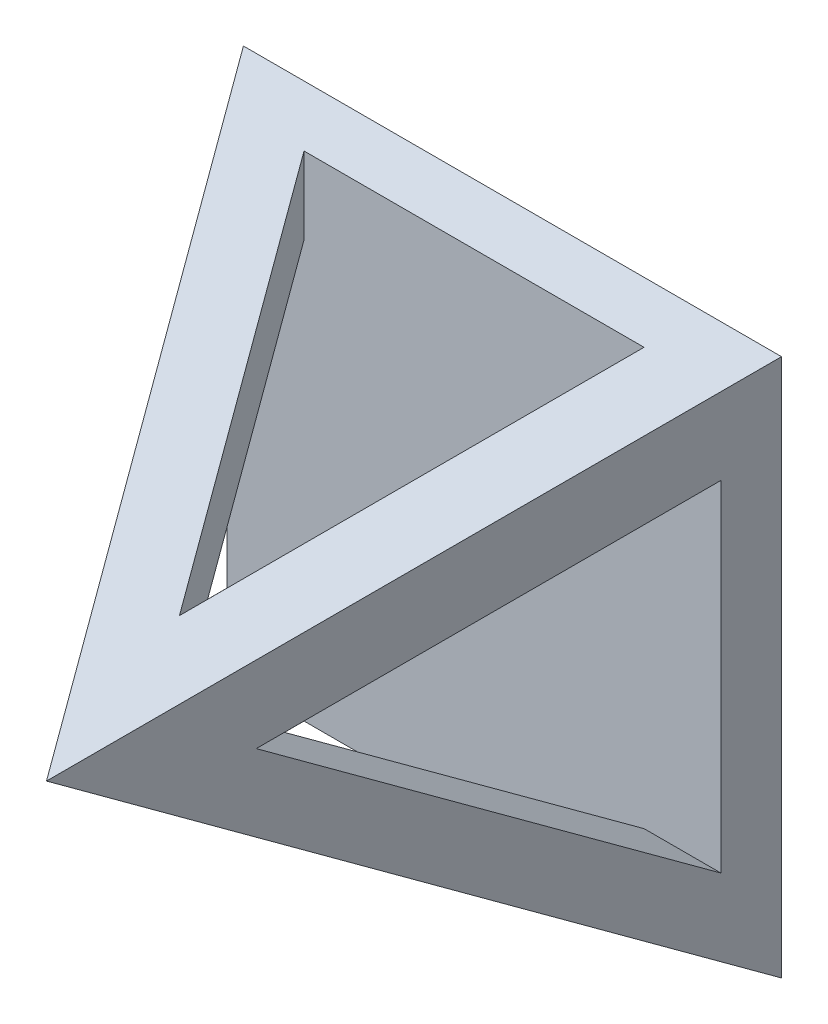
ISO-10303-21;
HEADER;
FILE_DESCRIPTION(('STEP AP214'),'2;1');
FILE_NAME('part.step','',(''),(''),'','','');
FILE_SCHEMA(('AUTOMOTIVE_DESIGN { 1 0 10303 214 1 1 1 1 }'));
ENDSEC;
DATA;
#1=APPLICATION_CONTEXT('core data for automotive mechanical design processes');
#2=APPLICATION_PROTOCOL_DEFINITION('international standard','automotive_design',2000,#1);
#3=PRODUCT_CONTEXT('',#1,'mechanical');
#4=PRODUCT('Part','Part','',(#3));
#5=PRODUCT_RELATED_PRODUCT_CATEGORY('part','',(#4));
#6=PRODUCT_DEFINITION_FORMATION('','',#4);
#7=PRODUCT_DEFINITION_CONTEXT('part definition',#1,'design');
#8=PRODUCT_DEFINITION('design','',#6,#7);
#9=PRODUCT_DEFINITION_SHAPE('','',#8);
#10=(LENGTH_UNIT() NAMED_UNIT(*) SI_UNIT(.MILLI.,.METRE.));
#11=(NAMED_UNIT(*) PLANE_ANGLE_UNIT() SI_UNIT($,.RADIAN.));
#12=(NAMED_UNIT(*) SI_UNIT($,.STERADIAN.) SOLID_ANGLE_UNIT());
#13=UNCERTAINTY_MEASURE_WITH_UNIT(LENGTH_MEASURE(1.E-05),#10,'distance_accuracy_value','');
#14=(GEOMETRIC_REPRESENTATION_CONTEXT(3) GLOBAL_UNCERTAINTY_ASSIGNED_CONTEXT((#13)) GLOBAL_UNIT_ASSIGNED_CONTEXT((#10,
#11,#12)) REPRESENTATION_CONTEXT('',''));
#15=CARTESIAN_POINT('',(0.,0.,0.));
#16=DIRECTION('',(0.,0.,1.));
#17=DIRECTION('',(1.,0.,0.));
#18=AXIS2_PLACEMENT_3D('',#15,#16,#17);
#19=CARTESIAN_POINT('',(-7.,7.,0.));
#20=DIRECTION('',(-0.866025403784438,0.,0.500000000000001));
#21=DIRECTION('',(0.500000000000001,0.,0.866025403784438));
#22=AXIS2_PLACEMENT_3D('',#19,#20,#21);
#23=PLANE('',#22);
#24=DIRECTION('',(0.,-1.,0.));
#25=VECTOR('',#24,1.);
#26=CARTESIAN_POINT('',(-7.,7.,0.));
#27=LINE('',#26,#25);
#28=CARTESIAN_POINT('',(-7.,7.,0.));
#29=VERTEX_POINT('',#28);
#30=CARTESIAN_POINT('',(-7.,-7.,0.));
#31=VERTEX_POINT('',#30);
#32=EDGE_CURVE('E161',#29,#31,#27,.T.);
#33=ORIENTED_EDGE('',*,*,#32,.T.);
#34=DIRECTION('',(-0.447213595499959,-0.447213595499959,-0.774596669241483));
#35=VECTOR('',#34,1.);
#36=CARTESIAN_POINT('',(-7.,-7.,0.));
#37=LINE('',#36,#35);
#38=CARTESIAN_POINT('',(0.,0.,12.1243556529821));
#39=VERTEX_POINT('',#38);
#40=EDGE_CURVE('E174',#39,#31,#37,.T.);
#41=ORIENTED_EDGE('',*,*,#40,.F.);
#42=DIRECTION('',(-0.447213595499959,0.447213595499959,-0.774596669241483));
#43=VECTOR('',#42,1.);
#44=CARTESIAN_POINT('',(-7.,7.,0.));
#45=LINE('',#44,#43);
#46=EDGE_CURVE('E173',#39,#29,#45,.T.);
#47=ORIENTED_EDGE('',*,*,#46,.T.);
#48=EDGE_LOOP('',(#33,#41,#47));
#49=FACE_BOUND('',#48,.T.);
#50=DIRECTION('',(0.,1.,0.));
#51=VECTOR('',#50,1.);
#52=CARTESIAN_POINT('',(-6.42264973081037,7.,0.999999999999999));
#53=LINE('',#52,#51);
#54=CARTESIAN_POINT('',(-6.42264973081037,4.42292304237542,0.999999999999999));
#55=VERTEX_POINT('',#54);
#56=CARTESIAN_POINT('',(-6.42264973081037,-4.42292304237547,0.999999999999999));
#57=VERTEX_POINT('',#56);
#58=EDGE_CURVE('E133',#55,#57,#53,.F.);
#59=ORIENTED_EDGE('',*,*,#58,.F.);
#60=DIRECTION('',(0.447255932734875,-0.447044206464897,0.77466999948341));
#61=VECTOR('',#60,1.);
#62=CARTESIAN_POINT('',(-7.39988634707236,5.39969704506764,-0.692623470382456));
#63=LINE('',#62,#61);
#64=CARTESIAN_POINT('',(-1.99763193139611,0.,8.66435565298211));
#65=VERTEX_POINT('',#64);
#66=EDGE_CURVE('E128',#65,#55,#63,.F.);
#67=ORIENTED_EDGE('',*,*,#66,.F.);
#68=DIRECTION('',(-0.447255932734875,-0.4470442064649,-0.774669999483409));
#69=VECTOR('',#68,1.);
#70=CARTESIAN_POINT('',(-4.60068191756582,-2.60181772959403,4.15574082229471));
#71=LINE('',#70,#69);
#72=EDGE_CURVE('E115',#57,#65,#71,.F.);
#73=ORIENTED_EDGE('',*,*,#72,.F.);
#74=EDGE_LOOP('',(#59,#67,#73));
#75=FACE_BOUND('',#74,.T.);
#76=ADVANCED_FACE('F33',(#49,#75),#23,.T.);
#77=CARTESIAN_POINT('',(7.,7.,0.));
#78=DIRECTION('',(0.866025403784438,0.,0.500000000000001));
#79=DIRECTION('',(0.500000000000001,0.,-0.866025403784438));
#80=AXIS2_PLACEMENT_3D('',#77,#78,#79);
#81=PLANE('',#80);
#82=DIRECTION('',(0.,1.,0.));
#83=VECTOR('',#82,1.);
#84=CARTESIAN_POINT('',(7.,7.,0.));
#85=LINE('',#84,#83);
#86=CARTESIAN_POINT('',(7.,-7.,0.));
#87=VERTEX_POINT('',#86);
#88=CARTESIAN_POINT('',(7.,7.,0.));
#89=VERTEX_POINT('',#88);
#90=EDGE_CURVE('E167',#87,#89,#85,.T.);
#91=ORIENTED_EDGE('',*,*,#90,.T.);
#92=DIRECTION('',(0.447213595499959,0.447213595499959,-0.774596669241483));
#93=VECTOR('',#92,1.);
#94=CARTESIAN_POINT('',(4.19999999999999,4.19999999999999,4.84974226119286));
#95=LINE('',#94,#93);
#96=EDGE_CURVE('E180',#39,#89,#95,.T.);
#97=ORIENTED_EDGE('',*,*,#96,.F.);
#98=DIRECTION('',(0.447213595499959,-0.447213595499959,-0.774596669241483));
#99=VECTOR('',#98,1.);
#100=CARTESIAN_POINT('',(4.19999999999999,-4.19999999999999,4.84974226119286));
#101=LINE('',#100,#99);
#102=EDGE_CURVE('E178',#39,#87,#101,.T.);
#103=ORIENTED_EDGE('',*,*,#102,.T.);
#104=EDGE_LOOP('',(#91,#97,#103));
#105=FACE_BOUND('',#104,.T.);
#106=DIRECTION('',(0.,-1.,0.));
#107=VECTOR('',#106,1.);
#108=CARTESIAN_POINT('',(6.42264973081037,7.,1.));
#109=LINE('',#108,#107);
#110=CARTESIAN_POINT('',(6.42264973081037,-4.42292304237543,1.));
#111=VERTEX_POINT('',#110);
#112=CARTESIAN_POINT('',(6.42264973081037,4.42292304237547,1.));
#113=VERTEX_POINT('',#112);
#114=EDGE_CURVE('E134',#111,#113,#109,.F.);
#115=ORIENTED_EDGE('',*,*,#114,.F.);
#116=DIRECTION('',(-0.447255932734875,0.447044206464898,0.77466999948341));
#117=VECTOR('',#116,1.);
#118=CARTESIAN_POINT('',(4.60068191756584,-2.60181772959402,4.15574082229468));
#119=LINE('',#118,#117);
#120=CARTESIAN_POINT('',(1.99763193139611,0.,8.66435565298211));
#121=VERTEX_POINT('',#120);
#122=EDGE_CURVE('E124',#121,#111,#119,.F.);
#123=ORIENTED_EDGE('',*,*,#122,.F.);
#124=DIRECTION('',(0.447255932734875,0.4470442064649,-0.774669999483409));
#125=VECTOR('',#124,1.);
#126=CARTESIAN_POINT('',(7.39988634707236,5.39969704506768,-0.692623470382442));
#127=LINE('',#126,#125);
#128=EDGE_CURVE('E135',#113,#121,#127,.F.);
#129=ORIENTED_EDGE('',*,*,#128,.F.);
#130=EDGE_LOOP('',(#115,#123,#129));
#131=FACE_BOUND('',#130,.T.);
#132=ADVANCED_FACE('F228',(#105,#131),#81,.T.);
#133=CARTESIAN_POINT('',(3.75088760529464,-7.,2.16455080765507));
#134=DIRECTION('',(-0.866127889551496,0.,-0.499822447416151));
#135=DIRECTION('',(-0.499822447416151,0.,0.866127889551496));
#136=AXIS2_PLACEMENT_3D('',#133,#134,#135);
#137=PLANE('',#136);
#138=DIRECTION('',(0.,1.,0.));
#139=VECTOR('',#138,1.);
#140=CARTESIAN_POINT('',(4.42292304237545,-7.,1.));
#141=LINE('',#140,#139);
#142=CARTESIAN_POINT('',(4.42292304237545,4.42292304237546,0.999999999999999));
#143=VERTEX_POINT('',#142);
#144=CARTESIAN_POINT('',(4.42292304237545,6.42264973081037,1.));
#145=VERTEX_POINT('',#144);
#146=EDGE_CURVE('E147',#143,#145,#141,.T.);
#147=ORIENTED_EDGE('',*,*,#146,.F.);
#148=DIRECTION('',(-0.447086535678458,-0.44708653567846,0.774743350555568));
#149=VECTOR('',#148,1.);
#150=CARTESIAN_POINT('',(1.60193170345558,1.60193170345558,5.8884144508768));
#151=LINE('',#150,#149);
#152=CARTESIAN_POINT('',(0.,0.,8.66435565298211));
#153=VERTEX_POINT('',#152);
#154=EDGE_CURVE('E123',#143,#153,#151,.T.);
#155=ORIENTED_EDGE('',*,*,#154,.T.);
#156=DIRECTION('',(0.,1.,0.));
#157=VECTOR('',#156,1.);
#158=CARTESIAN_POINT('',(0.,-7.,8.66435565298211));
#159=LINE('',#158,#157);
#160=CARTESIAN_POINT('',(0.,1.99763193139611,8.66435565298211));
#161=VERTEX_POINT('',#160);
#162=EDGE_CURVE('E151',#153,#161,#159,.T.);
#163=ORIENTED_EDGE('',*,*,#162,.T.);
#164=DIRECTION('',(-0.447044206464899,-0.447255932734875,0.77466999948341));
#165=VECTOR('',#164,1.);
#166=CARTESIAN_POINT('',(2.60181772959403,4.60068191756584,4.15574082229469));
#167=LINE('',#166,#165);
#168=EDGE_CURVE('E185',#161,#145,#167,.F.);
#169=ORIENTED_EDGE('',*,*,#168,.T.);
#170=EDGE_LOOP('',(#147,#155,#163,#169));
#171=FACE_BOUND('',#170,.T.);
#172=ADVANCED_FACE('F209',(#171),#137,.T.);
#173=CARTESIAN_POINT('',(0.,-1.99763193139611,8.66435565298211));
#174=VERTEX_POINT('',#173);
#175=EDGE_CURVE('E148',#174,#153,#159,.T.);
#176=ORIENTED_EDGE('',*,*,#175,.T.);
#177=DIRECTION('',(0.447086535678459,-0.447086535678458,-0.774743350555569));
#178=VECTOR('',#177,1.);
#179=CARTESIAN_POINT('',(4.4003408888451,-4.40034088884509,1.03913196191943));
#180=LINE('',#179,#178);
#181=CARTESIAN_POINT('',(4.42292304237545,-4.42292304237543,1.));
#182=VERTEX_POINT('',#181);
#183=EDGE_CURVE('E198',#153,#182,#180,.T.);
#184=ORIENTED_EDGE('',*,*,#183,.T.);
#185=CARTESIAN_POINT('',(4.42292304237545,-6.42264973081037,1.));
#186=VERTEX_POINT('',#185);
#187=EDGE_CURVE('E143',#186,#182,#141,.T.);
#188=ORIENTED_EDGE('',*,*,#187,.F.);
#189=DIRECTION('',(0.447044206464899,-0.447255932734875,-0.77466999948341));
#190=VECTOR('',#189,1.);
#191=CARTESIAN_POINT('',(2.60181772959403,-4.60068191756584,4.15574082229469));
#192=LINE('',#191,#190);
#193=EDGE_CURVE('E156',#186,#174,#192,.F.);
#194=ORIENTED_EDGE('',*,*,#193,.T.);
#195=EDGE_LOOP('',(#176,#184,#188,#194));
#196=FACE_BOUND('',#195,.T.);
#197=ADVANCED_FACE('F196',(#196),#137,.T.);
#198=CARTESIAN_POINT('',(-3.75088760529464,-7.,2.16455080765507));
#199=DIRECTION('',(0.866127889551496,0.,-0.499822447416151));
#200=DIRECTION('',(-0.499822447416151,0.,-0.866127889551496));
#201=AXIS2_PLACEMENT_3D('',#198,#199,#200);
#202=PLANE('',#201);
#203=ORIENTED_EDGE('',*,*,#162,.F.);
#204=DIRECTION('',(-0.447086535678459,0.447086535678457,-0.774743350555569));
#205=VECTOR('',#204,1.);
#206=CARTESIAN_POINT('',(-1.60193170345559,1.60193170345558,5.88841445087677));
#207=LINE('',#206,#205);
#208=CARTESIAN_POINT('',(-4.42292304237545,4.42292304237543,0.999999999999999));
#209=VERTEX_POINT('',#208);
#210=EDGE_CURVE('E11',#153,#209,#207,.T.);
#211=ORIENTED_EDGE('',*,*,#210,.T.);
#212=DIRECTION('',(0.,1.,0.));
#213=VECTOR('',#212,1.);
#214=CARTESIAN_POINT('',(-4.42292304237545,-7.,0.999999999999999));
#215=LINE('',#214,#213);
#216=CARTESIAN_POINT('',(-4.42292304237545,6.42264973081037,1.));
#217=VERTEX_POINT('',#216);
#218=EDGE_CURVE('E142',#209,#217,#215,.T.);
#219=ORIENTED_EDGE('',*,*,#218,.T.);
#220=DIRECTION('',(-0.447044206464899,0.447255932734875,-0.77466999948341));
#221=VECTOR('',#220,1.);
#222=CARTESIAN_POINT('',(-5.39969704506766,7.39988634707236,-0.692623470382449));
#223=LINE('',#222,#221);
#224=EDGE_CURVE('E177',#217,#161,#223,.F.);
#225=ORIENTED_EDGE('',*,*,#224,.T.);
#226=EDGE_LOOP('',(#203,#211,#219,#225));
#227=FACE_BOUND('',#226,.T.);
#228=ADVANCED_FACE('F203',(#227),#202,.T.);
#229=CARTESIAN_POINT('',(-4.42292304237545,-6.42264973081037,0.999999999999999));
#230=VERTEX_POINT('',#229);
#231=CARTESIAN_POINT('',(-4.42292304237545,-4.42292304237546,0.999999999999999));
#232=VERTEX_POINT('',#231);
#233=EDGE_CURVE('E152',#230,#232,#215,.T.);
#234=ORIENTED_EDGE('',*,*,#233,.T.);
#235=DIRECTION('',(0.447086535678459,0.44708653567846,0.774743350555568));
#236=VECTOR('',#235,1.);
#237=CARTESIAN_POINT('',(-4.4003408888451,-4.40034088884512,1.03913196191943));
#238=LINE('',#237,#236);
#239=EDGE_CURVE('E41',#232,#153,#238,.T.);
#240=ORIENTED_EDGE('',*,*,#239,.T.);
#241=ORIENTED_EDGE('',*,*,#175,.F.);
#242=DIRECTION('',(0.447044206464899,0.447255932734875,0.77466999948341));
#243=VECTOR('',#242,1.);
#244=CARTESIAN_POINT('',(-5.39969704506766,-7.39988634707236,-0.692623470382449));
#245=LINE('',#244,#243);
#246=EDGE_CURVE('E146',#174,#230,#245,.F.);
#247=ORIENTED_EDGE('',*,*,#246,.T.);
#248=EDGE_LOOP('',(#234,#240,#241,#247));
#249=FACE_BOUND('',#248,.T.);
#250=ADVANCED_FACE('F191',(#249),#202,.T.);
#251=CARTESIAN_POINT('',(-7.,-7.,0.));
#252=DIRECTION('',(0.,-0.866025403784438,0.500000000000001));
#253=DIRECTION('',(0.,-0.500000000000001,-0.866025403784438));
#254=AXIS2_PLACEMENT_3D('',#251,#252,#253);
#255=PLANE('',#254);
#256=DIRECTION('',(1.,0.,0.));
#257=VECTOR('',#256,1.);
#258=CARTESIAN_POINT('',(-7.,-7.,0.));
#259=LINE('',#258,#257);
#260=EDGE_CURVE('E164',#31,#87,#259,.T.);
#261=ORIENTED_EDGE('',*,*,#260,.T.);
#262=ORIENTED_EDGE('',*,*,#102,.F.);
#263=ORIENTED_EDGE('',*,*,#40,.T.);
#264=EDGE_LOOP('',(#261,#262,#263));
#265=FACE_BOUND('',#264,.T.);
#266=DIRECTION('',(-1.,0.,0.));
#267=VECTOR('',#266,1.);
#268=CARTESIAN_POINT('',(-7.,-6.42264973081037,0.999999999999999));
#269=LINE('',#268,#267);
#270=EDGE_CURVE('E159',#230,#186,#269,.F.);
#271=ORIENTED_EDGE('',*,*,#270,.F.);
#272=ORIENTED_EDGE('',*,*,#246,.F.);
#273=ORIENTED_EDGE('',*,*,#193,.F.);
#274=EDGE_LOOP('',(#271,#272,#273));
#275=FACE_BOUND('',#274,.T.);
#276=ADVANCED_FACE('F35',(#265,#275),#255,.T.);
#277=CARTESIAN_POINT('',(-7.,7.,0.));
#278=DIRECTION('',(0.,0.866025403784438,0.500000000000001));
#279=DIRECTION('',(0.,-0.500000000000001,0.866025403784438));
#280=AXIS2_PLACEMENT_3D('',#277,#278,#279);
#281=PLANE('',#280);
#282=DIRECTION('',(-1.,0.,0.));
#283=VECTOR('',#282,1.);
#284=CARTESIAN_POINT('',(-7.,7.,0.));
#285=LINE('',#284,#283);
#286=EDGE_CURVE('E170',#89,#29,#285,.T.);
#287=ORIENTED_EDGE('',*,*,#286,.T.);
#288=ORIENTED_EDGE('',*,*,#46,.F.);
#289=ORIENTED_EDGE('',*,*,#96,.T.);
#290=EDGE_LOOP('',(#287,#288,#289));
#291=FACE_BOUND('',#290,.T.);
#292=DIRECTION('',(1.,0.,0.));
#293=VECTOR('',#292,1.);
#294=CARTESIAN_POINT('',(-7.,6.42264973081037,0.999999999999999));
#295=LINE('',#294,#293);
#296=EDGE_CURVE('E188',#145,#217,#295,.F.);
#297=ORIENTED_EDGE('',*,*,#296,.F.);
#298=ORIENTED_EDGE('',*,*,#168,.F.);
#299=ORIENTED_EDGE('',*,*,#224,.F.);
#300=EDGE_LOOP('',(#297,#298,#299));
#301=FACE_BOUND('',#300,.T.);
#302=ADVANCED_FACE('F239',(#291,#301),#281,.T.);
#303=CARTESIAN_POINT('',(0.,0.,0.));
#304=DIRECTION('',(0.,0.,1.));
#305=DIRECTION('',(1.,0.,0.));
#306=AXIS2_PLACEMENT_3D('',#303,#304,#305);
#307=PLANE('',#306);
#308=ORIENTED_EDGE('',*,*,#32,.F.);
#309=ORIENTED_EDGE('',*,*,#286,.F.);
#310=ORIENTED_EDGE('',*,*,#90,.F.);
#311=ORIENTED_EDGE('',*,*,#260,.F.);
#312=EDGE_LOOP('',(#308,#309,#310,#311));
#313=FACE_BOUND('',#312,.T.);
#314=ADVANCED_FACE('F241',(#313),#307,.F.);
#315=CARTESIAN_POINT('',(0.,-7.,1.));
#316=DIRECTION('',(0.,0.,1.));
#317=DIRECTION('',(1.,0.,0.));
#318=AXIS2_PLACEMENT_3D('',#315,#316,#317);
#319=PLANE('',#318);
#320=DIRECTION('',(-1.,0.,0.));
#321=VECTOR('',#320,1.);
#322=CARTESIAN_POINT('',(7.00000000000001,4.42292304237547,1.));
#323=LINE('',#322,#321);
#324=EDGE_CURVE('E216',#113,#143,#323,.T.);
#325=ORIENTED_EDGE('',*,*,#324,.T.);
#326=ORIENTED_EDGE('',*,*,#146,.T.);
#327=ORIENTED_EDGE('',*,*,#296,.T.);
#328=ORIENTED_EDGE('',*,*,#218,.F.);
#329=EDGE_CURVE('E218',#209,#55,#323,.T.);
#330=ORIENTED_EDGE('',*,*,#329,.T.);
#331=ORIENTED_EDGE('',*,*,#58,.T.);
#332=DIRECTION('',(-1.,0.,0.));
#333=VECTOR('',#332,1.);
#334=CARTESIAN_POINT('',(7.00000000000004,-4.42292304237542,1.));
#335=LINE('',#334,#333);
#336=EDGE_CURVE('E48',#232,#57,#335,.T.);
#337=ORIENTED_EDGE('',*,*,#336,.F.);
#338=ORIENTED_EDGE('',*,*,#233,.F.);
#339=ORIENTED_EDGE('',*,*,#270,.T.);
#340=ORIENTED_EDGE('',*,*,#187,.T.);
#341=EDGE_CURVE('E131',#111,#182,#335,.T.);
#342=ORIENTED_EDGE('',*,*,#341,.F.);
#343=ORIENTED_EDGE('',*,*,#114,.T.);
#344=EDGE_LOOP('',(#325,#326,#327,#328,#330,#331,#337,#338,#339,#340,#342,#343));
#345=FACE_BOUND('',#344,.T.);
#346=ADVANCED_FACE('F226',(#345),#319,.T.);
#347=CARTESIAN_POINT('',(7.00000000000004,-3.75088760529462,2.16455080765507));
#348=DIRECTION('',(0.,0.866127889551496,-0.499822447416151));
#349=DIRECTION('',(0.,0.499822447416151,0.866127889551496));
#350=AXIS2_PLACEMENT_3D('',#347,#348,#349);
#351=PLANE('',#350);
#352=ORIENTED_EDGE('',*,*,#72,.T.);
#353=DIRECTION('',(-1.,0.,0.));
#354=VECTOR('',#353,1.);
#355=CARTESIAN_POINT('',(7.00000000000002,0.,8.66435565298211));
#356=LINE('',#355,#354);
#357=EDGE_CURVE('E118',#153,#65,#356,.T.);
#358=ORIENTED_EDGE('',*,*,#357,.F.);
#359=ORIENTED_EDGE('',*,*,#239,.F.);
#360=ORIENTED_EDGE('',*,*,#336,.T.);
#361=EDGE_LOOP('',(#352,#358,#359,#360));
#362=FACE_BOUND('',#361,.T.);
#363=ADVANCED_FACE('F117',(#362),#351,.T.);
#364=CARTESIAN_POINT('',(7.00000000000001,3.75088760529467,2.16455080765507));
#365=DIRECTION('',(0.,-0.866127889551496,-0.499822447416151));
#366=DIRECTION('',(0.,0.499822447416151,-0.866127889551496));
#367=AXIS2_PLACEMENT_3D('',#364,#365,#366);
#368=PLANE('',#367);
#369=ORIENTED_EDGE('',*,*,#66,.T.);
#370=ORIENTED_EDGE('',*,*,#329,.F.);
#371=ORIENTED_EDGE('',*,*,#210,.F.);
#372=ORIENTED_EDGE('',*,*,#357,.T.);
#373=EDGE_LOOP('',(#369,#370,#371,#372));
#374=FACE_BOUND('',#373,.T.);
#375=ADVANCED_FACE('F127',(#374),#368,.T.);
#376=ORIENTED_EDGE('',*,*,#128,.T.);
#377=EDGE_CURVE('E56',#121,#153,#356,.T.);
#378=ORIENTED_EDGE('',*,*,#377,.T.);
#379=ORIENTED_EDGE('',*,*,#154,.F.);
#380=ORIENTED_EDGE('',*,*,#324,.F.);
#381=EDGE_LOOP('',(#376,#378,#379,#380));
#382=FACE_BOUND('',#381,.T.);
#383=ADVANCED_FACE('F220',(#382),#368,.T.);
#384=ORIENTED_EDGE('',*,*,#122,.T.);
#385=ORIENTED_EDGE('',*,*,#341,.T.);
#386=ORIENTED_EDGE('',*,*,#183,.F.);
#387=ORIENTED_EDGE('',*,*,#377,.F.);
#388=EDGE_LOOP('',(#384,#385,#386,#387));
#389=FACE_BOUND('',#388,.T.);
#390=ADVANCED_FACE('F223',(#389),#351,.T.);
#391=CLOSED_SHELL('',(#76,#132,#172,#197,#228,#250,#276,#302,#314,#346,#363,#375,#383,#390));
#392=MANIFOLD_SOLID_BREP('B2',#391);
#393=ADVANCED_BREP_SHAPE_REPRESENTATION('',(#18,#392),#14);
#394=SHAPE_DEFINITION_REPRESENTATION(#9,#393);
ENDSEC;
END-ISO-10303-21;
